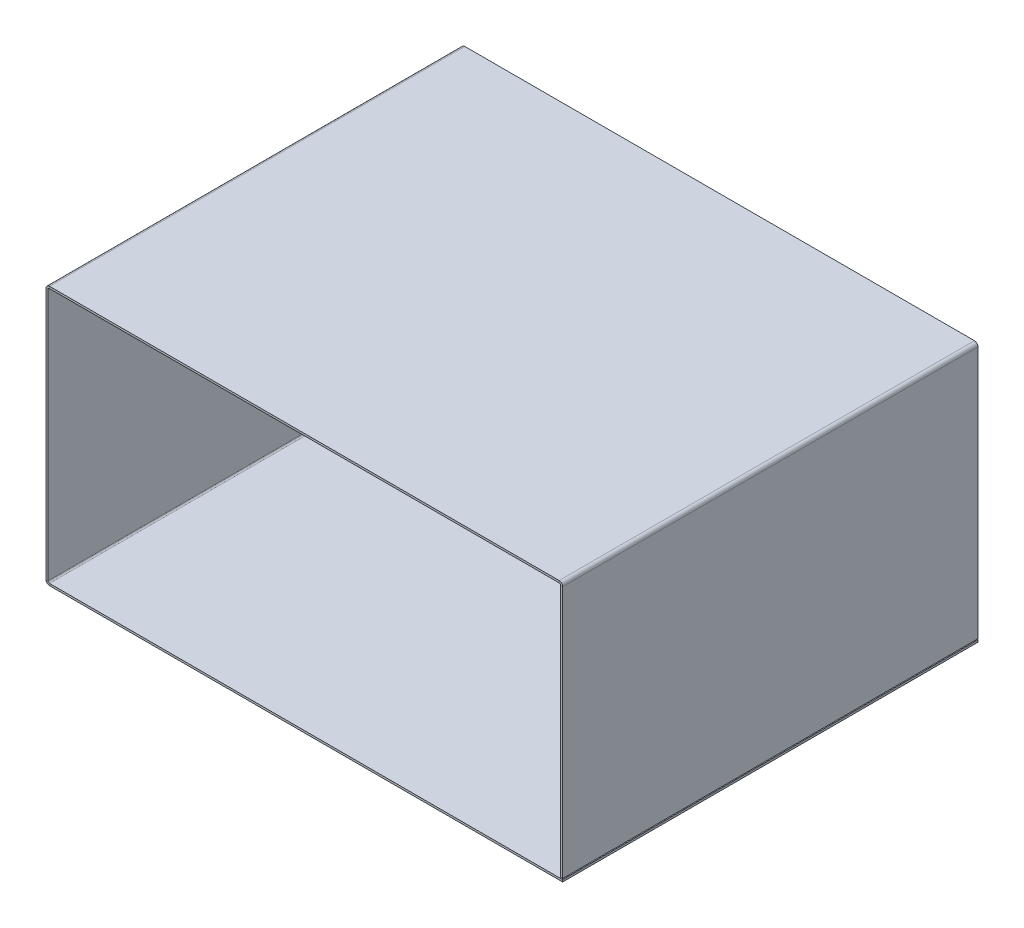
ISO-10303-21;
HEADER;
FILE_DESCRIPTION(('STEP AP214'),'2;1');
FILE_NAME('part.step','',(''),(''),'','','');
FILE_SCHEMA(('AUTOMOTIVE_DESIGN { 1 0 10303 214 1 1 1 1 }'));
ENDSEC;
DATA;
#1=APPLICATION_CONTEXT('core data for automotive mechanical design processes');
#2=APPLICATION_PROTOCOL_DEFINITION('international standard','automotive_design',2000,#1);
#3=PRODUCT_CONTEXT('',#1,'mechanical');
#4=PRODUCT('Part','Part','',(#3));
#5=PRODUCT_RELATED_PRODUCT_CATEGORY('part','',(#4));
#6=PRODUCT_DEFINITION_FORMATION('','',#4);
#7=PRODUCT_DEFINITION_CONTEXT('part definition',#1,'design');
#8=PRODUCT_DEFINITION('design','',#6,#7);
#9=PRODUCT_DEFINITION_SHAPE('','',#8);
#10=(LENGTH_UNIT() NAMED_UNIT(*) SI_UNIT(.MILLI.,.METRE.));
#11=(NAMED_UNIT(*) PLANE_ANGLE_UNIT() SI_UNIT($,.RADIAN.));
#12=(NAMED_UNIT(*) SI_UNIT($,.STERADIAN.) SOLID_ANGLE_UNIT());
#13=UNCERTAINTY_MEASURE_WITH_UNIT(LENGTH_MEASURE(1.E-05),#10,'distance_accuracy_value','');
#14=(GEOMETRIC_REPRESENTATION_CONTEXT(3) GLOBAL_UNCERTAINTY_ASSIGNED_CONTEXT((#13)) GLOBAL_UNIT_ASSIGNED_CONTEXT((#10,
#11,#12)) REPRESENTATION_CONTEXT('',''));
#15=CARTESIAN_POINT('',(0.,0.,0.));
#16=DIRECTION('',(0.,0.,1.));
#17=DIRECTION('',(1.,0.,0.));
#18=AXIS2_PLACEMENT_3D('',#15,#16,#17);
#19=CARTESIAN_POINT('',(127.5,127.000000000002,102.5));
#20=DIRECTION('',(0.,0.,-1.));
#21=DIRECTION('',(-1.,0.,0.));
#22=AXIS2_PLACEMENT_3D('',#19,#20,#21);
#23=PLANE('',#22);
#24=DIRECTION('',(0.,1.,0.));
#25=VECTOR('',#24,1.);
#26=CARTESIAN_POINT('',(125.7634,126.000000000002,102.5));
#27=LINE('',#26,#25);
#28=CARTESIAN_POINT('',(125.7634,126.000000000002,102.5));
#29=VERTEX_POINT('',#28);
#30=CARTESIAN_POINT('',(125.7634,127.000000000002,102.5));
#31=VERTEX_POINT('',#30);
#32=EDGE_CURVE('E269',#29,#31,#27,.T.);
#33=ORIENTED_EDGE('',*,*,#32,.T.);
#34=DIRECTION('',(1.,0.,0.));
#35=VECTOR('',#34,1.);
#36=CARTESIAN_POINT('',(-8.91669901038975E-13,127.000000000001,102.5));
#37=LINE('',#36,#35);
#38=CARTESIAN_POINT('',(-125.7634,127.,102.5));
#39=VERTEX_POINT('',#38);
#40=EDGE_CURVE('E284',#39,#31,#37,.T.);
#41=ORIENTED_EDGE('',*,*,#40,.F.);
#42=DIRECTION('',(0.,-1.,0.));
#43=VECTOR('',#42,1.);
#44=CARTESIAN_POINT('',(-125.7634,126.,102.5));
#45=LINE('',#44,#43);
#46=CARTESIAN_POINT('',(-125.7634,126.,102.5));
#47=VERTEX_POINT('',#46);
#48=EDGE_CURVE('E293',#47,#39,#45,.F.);
#49=ORIENTED_EDGE('',*,*,#48,.F.);
#50=DIRECTION('',(-1.,0.,0.));
#51=VECTOR('',#50,1.);
#52=CARTESIAN_POINT('',(127.5,126.000000000002,102.5));
#53=LINE('',#52,#51);
#54=EDGE_CURVE('E288',#47,#29,#53,.F.);
#55=ORIENTED_EDGE('',*,*,#54,.T.);
#56=EDGE_LOOP('',(#33,#41,#49,#55));
#57=FACE_BOUND('',#56,.T.);
#58=ADVANCED_FACE('F95',(#57),#23,.F.);
#59=CARTESIAN_POINT('',(-126.5,127.,-102.5));
#60=DIRECTION('',(0.,0.,1.));
#61=DIRECTION('',(1.,0.,0.));
#62=AXIS2_PLACEMENT_3D('',#59,#60,#61);
#63=PLANE('',#62);
#64=DIRECTION('',(0.,1.,0.));
#65=VECTOR('',#64,1.);
#66=CARTESIAN_POINT('',(125.7634,126.000000000002,-102.5));
#67=LINE('',#66,#65);
#68=CARTESIAN_POINT('',(125.7634,126.000000000002,-102.5));
#69=VERTEX_POINT('',#68);
#70=CARTESIAN_POINT('',(125.7634,127.000000000002,-102.5));
#71=VERTEX_POINT('',#70);
#72=EDGE_CURVE('E275',#69,#71,#67,.T.);
#73=ORIENTED_EDGE('',*,*,#72,.F.);
#74=DIRECTION('',(1.,0.,0.));
#75=VECTOR('',#74,1.);
#76=CARTESIAN_POINT('',(-126.5,126.,-102.5));
#77=LINE('',#76,#75);
#78=CARTESIAN_POINT('',(-125.7634,126.,-102.5));
#79=VERTEX_POINT('',#78);
#80=EDGE_CURVE('E286',#69,#79,#77,.F.);
#81=ORIENTED_EDGE('',*,*,#80,.T.);
#82=DIRECTION('',(0.,-1.,0.));
#83=VECTOR('',#82,1.);
#84=CARTESIAN_POINT('',(-125.7634,127.,-102.5));
#85=LINE('',#84,#83);
#86=CARTESIAN_POINT('',(-125.7634,127.,-102.5));
#87=VERTEX_POINT('',#86);
#88=EDGE_CURVE('E278',#79,#87,#85,.F.);
#89=ORIENTED_EDGE('',*,*,#88,.T.);
#90=DIRECTION('',(-1.,0.,0.));
#91=VECTOR('',#90,1.);
#92=CARTESIAN_POINT('',(-8.91669901038975E-13,127.000000000001,-102.5));
#93=LINE('',#92,#91);
#94=EDGE_CURVE('E281',#71,#87,#93,.T.);
#95=ORIENTED_EDGE('',*,*,#94,.F.);
#96=EDGE_LOOP('',(#73,#81,#89,#95));
#97=FACE_BOUND('',#96,.T.);
#98=ADVANCED_FACE('F415',(#97),#63,.F.);
#99=CARTESIAN_POINT('',(-8.91669901038975E-13,127.000000000001,0.));
#100=DIRECTION('',(0.,-1.,0.));
#101=DIRECTION('',(1.,0.,0.));
#102=AXIS2_PLACEMENT_3D('',#99,#100,#101);
#103=PLANE('',#102);
#104=DIRECTION('',(0.,0.,1.));
#105=VECTOR('',#104,1.);
#106=CARTESIAN_POINT('',(125.7634,127.000000000002,102.5));
#107=LINE('',#106,#105);
#108=EDGE_CURVE('E219',#31,#71,#107,.F.);
#109=ORIENTED_EDGE('',*,*,#108,.T.);
#110=ORIENTED_EDGE('',*,*,#94,.T.);
#111=DIRECTION('',(0.,0.,1.));
#112=VECTOR('',#111,1.);
#113=CARTESIAN_POINT('',(-125.7634,127.,-102.5));
#114=LINE('',#113,#112);
#115=EDGE_CURVE('E290',#39,#87,#114,.F.);
#116=ORIENTED_EDGE('',*,*,#115,.F.);
#117=ORIENTED_EDGE('',*,*,#40,.T.);
#118=EDGE_LOOP('',(#109,#110,#116,#117));
#119=FACE_BOUND('',#118,.T.);
#120=ADVANCED_FACE('F446',(#119),#103,.F.);
#121=CARTESIAN_POINT('',(-8.84681654268241E-13,126.000000000001,0.));
#122=DIRECTION('',(0.,-1.,0.));
#123=DIRECTION('',(1.,0.,0.));
#124=AXIS2_PLACEMENT_3D('',#121,#122,#123);
#125=PLANE('',#124);
#126=ORIENTED_EDGE('',*,*,#80,.F.);
#127=DIRECTION('',(0.,0.,1.));
#128=VECTOR('',#127,1.);
#129=CARTESIAN_POINT('',(125.7634,126.000000000002,102.5));
#130=LINE('',#129,#128);
#131=EDGE_CURVE('E110',#29,#69,#130,.F.);
#132=ORIENTED_EDGE('',*,*,#131,.F.);
#133=ORIENTED_EDGE('',*,*,#54,.F.);
#134=DIRECTION('',(0.,0.,1.));
#135=VECTOR('',#134,1.);
#136=CARTESIAN_POINT('',(-125.7634,126.,-102.5));
#137=LINE('',#136,#135);
#138=EDGE_CURVE('E296',#79,#47,#137,.T.);
#139=ORIENTED_EDGE('',*,*,#138,.F.);
#140=EDGE_LOOP('',(#126,#132,#133,#139));
#141=FACE_BOUND('',#140,.T.);
#142=ADVANCED_FACE('F416',(#141),#125,.T.);
#143=CARTESIAN_POINT('',(-127.5,127.,102.5));
#144=DIRECTION('',(0.,0.,-1.));
#145=DIRECTION('',(-1.,0.,0.));
#146=AXIS2_PLACEMENT_3D('',#143,#144,#145);
#147=PLANE('',#146);
#148=DIRECTION('',(-1.,0.,0.));
#149=VECTOR('',#148,1.);
#150=CARTESIAN_POINT('',(-126.5,125.2634,102.5));
#151=LINE('',#150,#149);
#152=CARTESIAN_POINT('',(-126.5,125.2634,102.5));
#153=VERTEX_POINT('',#152);
#154=CARTESIAN_POINT('',(-127.5,125.2634,102.5));
#155=VERTEX_POINT('',#154);
#156=EDGE_CURVE('E306',#153,#155,#151,.T.);
#157=ORIENTED_EDGE('',*,*,#156,.T.);
#158=DIRECTION('',(0.,1.,0.));
#159=VECTOR('',#158,1.);
#160=CARTESIAN_POINT('',(-127.5,-4.49329073904851E-13,102.5));
#161=LINE('',#160,#159);
#162=CARTESIAN_POINT('',(-127.5,0.7366,102.5));
#163=VERTEX_POINT('',#162);
#164=EDGE_CURVE('E324',#163,#155,#161,.T.);
#165=ORIENTED_EDGE('',*,*,#164,.F.);
#166=DIRECTION('',(1.,0.,0.));
#167=VECTOR('',#166,1.);
#168=CARTESIAN_POINT('',(-126.5,0.736600000000004,102.5));
#169=LINE('',#168,#167);
#170=CARTESIAN_POINT('',(-126.5,0.736600000000004,102.5));
#171=VERTEX_POINT('',#170);
#172=EDGE_CURVE('E333',#171,#163,#169,.F.);
#173=ORIENTED_EDGE('',*,*,#172,.F.);
#174=DIRECTION('',(0.,-1.,0.));
#175=VECTOR('',#174,1.);
#176=CARTESIAN_POINT('',(-126.5,127.,102.5));
#177=LINE('',#176,#175);
#178=EDGE_CURVE('E328',#171,#153,#177,.F.);
#179=ORIENTED_EDGE('',*,*,#178,.T.);
#180=EDGE_LOOP('',(#157,#165,#173,#179));
#181=FACE_BOUND('',#180,.T.);
#182=ADVANCED_FACE('F470',(#181),#147,.F.);
#183=CARTESIAN_POINT('',(-127.5,0.,-102.5));
#184=DIRECTION('',(0.,0.,1.));
#185=DIRECTION('',(1.,0.,0.));
#186=AXIS2_PLACEMENT_3D('',#183,#184,#185);
#187=PLANE('',#186);
#188=DIRECTION('',(-1.,0.,0.));
#189=VECTOR('',#188,1.);
#190=CARTESIAN_POINT('',(-126.5,125.2634,-102.5));
#191=LINE('',#190,#189);
#192=CARTESIAN_POINT('',(-126.5,125.2634,-102.5));
#193=VERTEX_POINT('',#192);
#194=CARTESIAN_POINT('',(-127.5,125.2634,-102.5));
#195=VERTEX_POINT('',#194);
#196=EDGE_CURVE('E315',#193,#195,#191,.T.);
#197=ORIENTED_EDGE('',*,*,#196,.F.);
#198=DIRECTION('',(0.,1.,0.));
#199=VECTOR('',#198,1.);
#200=CARTESIAN_POINT('',(-126.5,0.,-102.5));
#201=LINE('',#200,#199);
#202=CARTESIAN_POINT('',(-126.5,0.736600000000004,-102.5));
#203=VERTEX_POINT('',#202);
#204=EDGE_CURVE('E326',#193,#203,#201,.F.);
#205=ORIENTED_EDGE('',*,*,#204,.T.);
#206=DIRECTION('',(1.,0.,0.));
#207=VECTOR('',#206,1.);
#208=CARTESIAN_POINT('',(-127.5,0.7366,-102.5));
#209=LINE('',#208,#207);
#210=CARTESIAN_POINT('',(-127.5,0.7366,-102.5));
#211=VERTEX_POINT('',#210);
#212=EDGE_CURVE('E318',#203,#211,#209,.F.);
#213=ORIENTED_EDGE('',*,*,#212,.T.);
#214=DIRECTION('',(0.,-1.,0.));
#215=VECTOR('',#214,1.);
#216=CARTESIAN_POINT('',(-127.5,-4.49329073904851E-13,-102.5));
#217=LINE('',#216,#215);
#218=EDGE_CURVE('E321',#195,#211,#217,.T.);
#219=ORIENTED_EDGE('',*,*,#218,.F.);
#220=EDGE_LOOP('',(#197,#205,#213,#219));
#221=FACE_BOUND('',#220,.T.);
#222=ADVANCED_FACE('F402',(#221),#187,.F.);
#223=CARTESIAN_POINT('',(-127.5,-4.49329073904851E-13,0.));
#224=DIRECTION('',(1.,0.,0.));
#225=DIRECTION('',(0.,1.,0.));
#226=AXIS2_PLACEMENT_3D('',#223,#224,#225);
#227=PLANE('',#226);
#228=DIRECTION('',(0.,0.,1.));
#229=VECTOR('',#228,1.);
#230=CARTESIAN_POINT('',(-127.5,125.2634,102.5));
#231=LINE('',#230,#229);
#232=EDGE_CURVE('E300',#155,#195,#231,.F.);
#233=ORIENTED_EDGE('',*,*,#232,.T.);
#234=ORIENTED_EDGE('',*,*,#218,.T.);
#235=DIRECTION('',(0.,0.,1.));
#236=VECTOR('',#235,1.);
#237=CARTESIAN_POINT('',(-127.5,0.7366,-102.5));
#238=LINE('',#237,#236);
#239=EDGE_CURVE('E330',#163,#211,#238,.F.);
#240=ORIENTED_EDGE('',*,*,#239,.F.);
#241=ORIENTED_EDGE('',*,*,#164,.T.);
#242=EDGE_LOOP('',(#233,#234,#240,#241));
#243=FACE_BOUND('',#242,.T.);
#244=ADVANCED_FACE('F462',(#243),#227,.F.);
#245=CARTESIAN_POINT('',(-126.5,-4.45837592566008E-13,0.));
#246=DIRECTION('',(1.,0.,0.));
#247=DIRECTION('',(0.,1.,0.));
#248=AXIS2_PLACEMENT_3D('',#245,#246,#247);
#249=PLANE('',#248);
#250=ORIENTED_EDGE('',*,*,#204,.F.);
#251=DIRECTION('',(0.,0.,1.));
#252=VECTOR('',#251,1.);
#253=CARTESIAN_POINT('',(-126.5,125.2634,102.5));
#254=LINE('',#253,#252);
#255=EDGE_CURVE('E118',#153,#193,#254,.F.);
#256=ORIENTED_EDGE('',*,*,#255,.F.);
#257=ORIENTED_EDGE('',*,*,#178,.F.);
#258=DIRECTION('',(0.,0.,1.));
#259=VECTOR('',#258,1.);
#260=CARTESIAN_POINT('',(-126.5,0.736600000000004,-102.5));
#261=LINE('',#260,#259);
#262=EDGE_CURVE('E336',#203,#171,#261,.T.);
#263=ORIENTED_EDGE('',*,*,#262,.F.);
#264=EDGE_LOOP('',(#250,#256,#257,#263));
#265=FACE_BOUND('',#264,.T.);
#266=ADVANCED_FACE('F403',(#265),#249,.T.);
#267=CARTESIAN_POINT('',(-127.5,-1.,102.5));
#268=DIRECTION('',(0.,0.,1.));
#269=DIRECTION('',(1.,0.,0.));
#270=AXIS2_PLACEMENT_3D('',#267,#268,#269);
#271=PLANE('',#270);
#272=DIRECTION('',(1.,0.,0.));
#273=VECTOR('',#272,1.);
#274=CARTESIAN_POINT('',(-127.5,0.,102.5));
#275=LINE('',#274,#273);
#276=CARTESIAN_POINT('',(-125.7634,0.,102.5));
#277=VERTEX_POINT('',#276);
#278=CARTESIAN_POINT('',(127.5,0.,102.5));
#279=VERTEX_POINT('',#278);
#280=EDGE_CURVE('E367',#277,#279,#275,.T.);
#281=ORIENTED_EDGE('',*,*,#280,.F.);
#282=DIRECTION('',(0.,-1.,0.));
#283=VECTOR('',#282,1.);
#284=CARTESIAN_POINT('',(-125.7634,0.,102.5));
#285=LINE('',#284,#283);
#286=CARTESIAN_POINT('',(-125.7634,-0.999999999999997,102.5));
#287=VERTEX_POINT('',#286);
#288=EDGE_CURVE('E346',#277,#287,#285,.T.);
#289=ORIENTED_EDGE('',*,*,#288,.T.);
#290=DIRECTION('',(1.,0.,0.));
#291=VECTOR('',#290,1.);
#292=CARTESIAN_POINT('',(-127.5,-1.,102.5));
#293=LINE('',#292,#291);
#294=CARTESIAN_POINT('',(127.5,-1.,102.5));
#295=VERTEX_POINT('',#294);
#296=EDGE_CURVE('E370',#287,#295,#293,.T.);
#297=ORIENTED_EDGE('',*,*,#296,.T.);
#298=DIRECTION('',(0.,1.,0.));
#299=VECTOR('',#298,1.);
#300=CARTESIAN_POINT('',(127.5,-1.,102.5));
#301=LINE('',#300,#299);
#302=EDGE_CURVE('E13',#295,#279,#301,.T.);
#303=ORIENTED_EDGE('',*,*,#302,.T.);
#304=EDGE_LOOP('',(#281,#289,#297,#303));
#305=FACE_BOUND('',#304,.T.);
#306=ADVANCED_FACE('F384',(#305),#271,.T.);
#307=CARTESIAN_POINT('',(0.,-1.,0.));
#308=DIRECTION('',(0.,1.,0.));
#309=DIRECTION('',(0.,0.,1.));
#310=AXIS2_PLACEMENT_3D('',#307,#308,#309);
#311=PLANE('',#310);
#312=DIRECTION('',(0.,0.,1.));
#313=VECTOR('',#312,1.);
#314=CARTESIAN_POINT('',(-125.7634,-0.999999999999997,102.5));
#315=LINE('',#314,#313);
#316=CARTESIAN_POINT('',(-125.7634,-1.,-102.5));
#317=VERTEX_POINT('',#316);
#318=EDGE_CURVE('E340',#287,#317,#315,.F.);
#319=ORIENTED_EDGE('',*,*,#318,.T.);
#320=DIRECTION('',(-1.,0.,0.));
#321=VECTOR('',#320,1.);
#322=CARTESIAN_POINT('',(-127.5,-1.,-102.5));
#323=LINE('',#322,#321);
#324=CARTESIAN_POINT('',(127.5,-1.,-102.5));
#325=VERTEX_POINT('',#324);
#326=EDGE_CURVE('E366',#325,#317,#323,.T.);
#327=ORIENTED_EDGE('',*,*,#326,.F.);
#328=DIRECTION('',(0.,0.,-1.));
#329=VECTOR('',#328,1.);
#330=CARTESIAN_POINT('',(127.5,-1.,-102.5));
#331=LINE('',#330,#329);
#332=EDGE_CURVE('E363',#295,#325,#331,.T.);
#333=ORIENTED_EDGE('',*,*,#332,.F.);
#334=ORIENTED_EDGE('',*,*,#296,.F.);
#335=EDGE_LOOP('',(#319,#327,#333,#334));
#336=FACE_BOUND('',#335,.T.);
#337=ADVANCED_FACE('F486',(#336),#311,.F.);
#338=CARTESIAN_POINT('',(0.,0.,0.));
#339=DIRECTION('',(0.,1.,0.));
#340=DIRECTION('',(0.,0.,1.));
#341=AXIS2_PLACEMENT_3D('',#338,#339,#340);
#342=PLANE('',#341);
#343=DIRECTION('',(-1.,0.,0.));
#344=VECTOR('',#343,1.);
#345=CARTESIAN_POINT('',(-127.5,0.,-102.5));
#346=LINE('',#345,#344);
#347=CARTESIAN_POINT('',(127.5,0.,-102.5));
#348=VERTEX_POINT('',#347);
#349=CARTESIAN_POINT('',(-125.7634,0.,-102.5));
#350=VERTEX_POINT('',#349);
#351=EDGE_CURVE('E374',#348,#350,#346,.T.);
#352=ORIENTED_EDGE('',*,*,#351,.T.);
#353=DIRECTION('',(0.,0.,1.));
#354=VECTOR('',#353,1.);
#355=CARTESIAN_POINT('',(-125.7634,0.,102.5));
#356=LINE('',#355,#354);
#357=EDGE_CURVE('E352',#277,#350,#356,.F.);
#358=ORIENTED_EDGE('',*,*,#357,.F.);
#359=ORIENTED_EDGE('',*,*,#280,.T.);
#360=DIRECTION('',(0.,0.,-1.));
#361=VECTOR('',#360,1.);
#362=CARTESIAN_POINT('',(127.5,0.,-102.5));
#363=LINE('',#362,#361);
#364=EDGE_CURVE('E360',#279,#348,#363,.T.);
#365=ORIENTED_EDGE('',*,*,#364,.T.);
#366=EDGE_LOOP('',(#352,#358,#359,#365));
#367=FACE_BOUND('',#366,.T.);
#368=ADVANCED_FACE('F379',(#367),#342,.T.);
#369=CARTESIAN_POINT('',(127.5,-1.,-102.5));
#370=DIRECTION('',(1.,0.,0.));
#371=DIRECTION('',(0.,0.,-1.));
#372=AXIS2_PLACEMENT_3D('',#369,#370,#371);
#373=PLANE('',#372);
#374=ORIENTED_EDGE('',*,*,#364,.F.);
#375=ORIENTED_EDGE('',*,*,#302,.F.);
#376=ORIENTED_EDGE('',*,*,#332,.T.);
#377=DIRECTION('',(0.,1.,0.));
#378=VECTOR('',#377,1.);
#379=CARTESIAN_POINT('',(127.5,-1.,-102.5));
#380=LINE('',#379,#378);
#381=EDGE_CURVE('E99',#325,#348,#380,.T.);
#382=ORIENTED_EDGE('',*,*,#381,.T.);
#383=EDGE_LOOP('',(#374,#375,#376,#382));
#384=FACE_BOUND('',#383,.T.);
#385=ADVANCED_FACE('F97',(#384),#373,.T.);
#386=CARTESIAN_POINT('',(-127.5,-1.,-102.5));
#387=DIRECTION('',(0.,0.,-1.));
#388=DIRECTION('',(-1.,0.,0.));
#389=AXIS2_PLACEMENT_3D('',#386,#387,#388);
#390=PLANE('',#389);
#391=DIRECTION('',(0.,-1.,0.));
#392=VECTOR('',#391,1.);
#393=CARTESIAN_POINT('',(-125.7634,0.,-102.5));
#394=LINE('',#393,#392);
#395=EDGE_CURVE('E357',#350,#317,#394,.T.);
#396=ORIENTED_EDGE('',*,*,#395,.F.);
#397=ORIENTED_EDGE('',*,*,#351,.F.);
#398=ORIENTED_EDGE('',*,*,#381,.F.);
#399=ORIENTED_EDGE('',*,*,#326,.T.);
#400=EDGE_LOOP('',(#396,#397,#398,#399));
#401=FACE_BOUND('',#400,.T.);
#402=ADVANCED_FACE('F390',(#401),#390,.T.);
#403=CARTESIAN_POINT('',(-125.7634,0.736600000000006,-102.5));
#404=DIRECTION('',(0.,0.,-1.));
#405=DIRECTION('',(-1.,0.,0.));
#406=AXIS2_PLACEMENT_3D('',#403,#404,#405);
#407=PLANE('',#406);
#408=ORIENTED_EDGE('',*,*,#212,.F.);
#409=CARTESIAN_POINT('',(-125.7634,0.736600000000006,-102.5));
#410=DIRECTION('',(0.,0.,1.));
#411=DIRECTION('',(1.,0.,0.));
#412=AXIS2_PLACEMENT_3D('',#409,#410,#411);
#413=CIRCLE('',#412,0.736600000000004);
#414=EDGE_CURVE('E349',#350,#203,#413,.F.);
#415=ORIENTED_EDGE('',*,*,#414,.F.);
#416=ORIENTED_EDGE('',*,*,#395,.T.);
#417=CARTESIAN_POINT('',(-125.7634,0.736600000000006,-102.5));
#418=DIRECTION('',(0.,0.,1.));
#419=DIRECTION('',(1.,0.,0.));
#420=AXIS2_PLACEMENT_3D('',#417,#418,#419);
#421=CIRCLE('',#420,1.7366);
#422=EDGE_CURVE('E342',#317,#211,#421,.F.);
#423=ORIENTED_EDGE('',*,*,#422,.T.);
#424=EDGE_LOOP('',(#408,#415,#416,#423));
#425=FACE_BOUND('',#424,.T.);
#426=ADVANCED_FACE('F398',(#425),#407,.T.);
#427=CARTESIAN_POINT('',(-125.7634,0.736600000000006,102.5));
#428=DIRECTION('',(0.,0.,-1.));
#429=DIRECTION('',(-1.,0.,0.));
#430=AXIS2_PLACEMENT_3D('',#427,#428,#429);
#431=PLANE('',#430);
#432=CARTESIAN_POINT('',(-125.7634,0.736600000000006,102.5));
#433=DIRECTION('',(0.,0.,1.));
#434=DIRECTION('',(1.,0.,0.));
#435=AXIS2_PLACEMENT_3D('',#432,#433,#434);
#436=CIRCLE('',#435,0.736600000000004);
#437=EDGE_CURVE('E323',#171,#277,#436,.T.);
#438=ORIENTED_EDGE('',*,*,#437,.F.);
#439=ORIENTED_EDGE('',*,*,#172,.T.);
#440=CARTESIAN_POINT('',(-125.7634,0.736600000000006,102.5));
#441=DIRECTION('',(0.,0.,1.));
#442=DIRECTION('',(1.,0.,0.));
#443=AXIS2_PLACEMENT_3D('',#440,#441,#442);
#444=CIRCLE('',#443,1.7366);
#445=EDGE_CURVE('E343',#163,#287,#444,.T.);
#446=ORIENTED_EDGE('',*,*,#445,.T.);
#447=ORIENTED_EDGE('',*,*,#288,.F.);
#448=EDGE_LOOP('',(#438,#439,#446,#447));
#449=FACE_BOUND('',#448,.T.);
#450=ADVANCED_FACE('F477',(#449),#431,.F.);
#451=CARTESIAN_POINT('',(-125.7634,0.736600000000006,102.5));
#452=DIRECTION('',(0.,0.,1.));
#453=DIRECTION('',(-1.,0.,0.));
#454=AXIS2_PLACEMENT_3D('',#451,#452,#453);
#455=CYLINDRICAL_SURFACE('',#454,1.7366);
#456=ORIENTED_EDGE('',*,*,#318,.F.);
#457=ORIENTED_EDGE('',*,*,#445,.F.);
#458=ORIENTED_EDGE('',*,*,#239,.T.);
#459=ORIENTED_EDGE('',*,*,#422,.F.);
#460=EDGE_LOOP('',(#456,#457,#458,#459));
#461=FACE_BOUND('',#460,.T.);
#462=ADVANCED_FACE('F474',(#461),#455,.T.);
#463=CARTESIAN_POINT('',(-125.7634,0.736600000000006,102.5));
#464=DIRECTION('',(0.,0.,1.));
#465=DIRECTION('',(-1.,0.,0.));
#466=AXIS2_PLACEMENT_3D('',#463,#464,#465);
#467=CYLINDRICAL_SURFACE('',#466,0.736600000000004);
#468=ORIENTED_EDGE('',*,*,#357,.T.);
#469=ORIENTED_EDGE('',*,*,#414,.T.);
#470=ORIENTED_EDGE('',*,*,#262,.T.);
#471=ORIENTED_EDGE('',*,*,#437,.T.);
#472=EDGE_LOOP('',(#468,#469,#470,#471));
#473=FACE_BOUND('',#472,.T.);
#474=ADVANCED_FACE('F393',(#473),#467,.F.);
#475=CARTESIAN_POINT('',(-125.7634,125.2634,-102.5));
#476=DIRECTION('',(0.,0.,-1.));
#477=DIRECTION('',(-1.,0.,0.));
#478=AXIS2_PLACEMENT_3D('',#475,#476,#477);
#479=PLANE('',#478);
#480=ORIENTED_EDGE('',*,*,#88,.F.);
#481=CARTESIAN_POINT('',(-125.7634,125.2634,-102.5));
#482=DIRECTION('',(0.,0.,1.));
#483=DIRECTION('',(1.,0.,0.));
#484=AXIS2_PLACEMENT_3D('',#481,#482,#483);
#485=CIRCLE('',#484,0.736600000000004);
#486=EDGE_CURVE('E309',#193,#79,#485,.F.);
#487=ORIENTED_EDGE('',*,*,#486,.F.);
#488=ORIENTED_EDGE('',*,*,#196,.T.);
#489=CARTESIAN_POINT('',(-125.7634,125.2634,-102.5));
#490=DIRECTION('',(0.,0.,1.));
#491=DIRECTION('',(1.,0.,0.));
#492=AXIS2_PLACEMENT_3D('',#489,#490,#491);
#493=CIRCLE('',#492,1.7366);
#494=EDGE_CURVE('E302',#195,#87,#493,.F.);
#495=ORIENTED_EDGE('',*,*,#494,.T.);
#496=EDGE_LOOP('',(#480,#487,#488,#495));
#497=FACE_BOUND('',#496,.T.);
#498=ADVANCED_FACE('F411',(#497),#479,.T.);
#499=CARTESIAN_POINT('',(-125.7634,125.2634,102.5));
#500=DIRECTION('',(0.,0.,-1.));
#501=DIRECTION('',(-1.,0.,0.));
#502=AXIS2_PLACEMENT_3D('',#499,#500,#501);
#503=PLANE('',#502);
#504=CARTESIAN_POINT('',(-125.7634,125.2634,102.5));
#505=DIRECTION('',(0.,0.,1.));
#506=DIRECTION('',(1.,0.,0.));
#507=AXIS2_PLACEMENT_3D('',#504,#505,#506);
#508=CIRCLE('',#507,0.736600000000004);
#509=EDGE_CURVE('E283',#47,#153,#508,.T.);
#510=ORIENTED_EDGE('',*,*,#509,.F.);
#511=ORIENTED_EDGE('',*,*,#48,.T.);
#512=CARTESIAN_POINT('',(-125.7634,125.2634,102.5));
#513=DIRECTION('',(0.,0.,1.));
#514=DIRECTION('',(1.,0.,0.));
#515=AXIS2_PLACEMENT_3D('',#512,#513,#514);
#516=CIRCLE('',#515,1.7366);
#517=EDGE_CURVE('E303',#39,#155,#516,.T.);
#518=ORIENTED_EDGE('',*,*,#517,.T.);
#519=ORIENTED_EDGE('',*,*,#156,.F.);
#520=EDGE_LOOP('',(#510,#511,#518,#519));
#521=FACE_BOUND('',#520,.T.);
#522=ADVANCED_FACE('F453',(#521),#503,.F.);
#523=CARTESIAN_POINT('',(-125.7634,125.2634,102.5));
#524=DIRECTION('',(0.,0.,1.));
#525=DIRECTION('',(0.,1.,0.));
#526=AXIS2_PLACEMENT_3D('',#523,#524,#525);
#527=CYLINDRICAL_SURFACE('',#526,1.7366);
#528=ORIENTED_EDGE('',*,*,#232,.F.);
#529=ORIENTED_EDGE('',*,*,#517,.F.);
#530=ORIENTED_EDGE('',*,*,#115,.T.);
#531=ORIENTED_EDGE('',*,*,#494,.F.);
#532=EDGE_LOOP('',(#528,#529,#530,#531));
#533=FACE_BOUND('',#532,.T.);
#534=ADVANCED_FACE('F450',(#533),#527,.T.);
#535=CARTESIAN_POINT('',(-125.7634,125.2634,102.5));
#536=DIRECTION('',(0.,0.,1.));
#537=DIRECTION('',(0.,1.,0.));
#538=AXIS2_PLACEMENT_3D('',#535,#536,#537);
#539=CYLINDRICAL_SURFACE('',#538,0.736600000000004);
#540=ORIENTED_EDGE('',*,*,#255,.T.);
#541=ORIENTED_EDGE('',*,*,#486,.T.);
#542=ORIENTED_EDGE('',*,*,#138,.T.);
#543=ORIENTED_EDGE('',*,*,#509,.T.);
#544=EDGE_LOOP('',(#540,#541,#542,#543));
#545=FACE_BOUND('',#544,.T.);
#546=ADVANCED_FACE('F406',(#545),#539,.F.);
#547=CARTESIAN_POINT('',(125.7634,125.263400000002,-102.5));
#548=DIRECTION('',(0.,0.,-1.));
#549=DIRECTION('',(-1.,0.,0.));
#550=AXIS2_PLACEMENT_3D('',#547,#548,#549);
#551=PLANE('',#550);
#552=DIRECTION('',(1.,0.,0.));
#553=VECTOR('',#552,1.);
#554=CARTESIAN_POINT('',(127.5,125.263400000002,-102.5));
#555=LINE('',#554,#553);
#556=CARTESIAN_POINT('',(126.5,125.263400000002,-102.5));
#557=VERTEX_POINT('',#556);
#558=CARTESIAN_POINT('',(127.5,125.263400000002,-102.5));
#559=VERTEX_POINT('',#558);
#560=EDGE_CURVE('E264',#557,#559,#555,.T.);
#561=ORIENTED_EDGE('',*,*,#560,.F.);
#562=CARTESIAN_POINT('',(125.7634,125.263400000002,-102.5));
#563=DIRECTION('',(0.,0.,1.));
#564=DIRECTION('',(1.,0.,0.));
#565=AXIS2_PLACEMENT_3D('',#562,#563,#564);
#566=CIRCLE('',#565,0.736600000000004);
#567=EDGE_CURVE('E222',#69,#557,#566,.F.);
#568=ORIENTED_EDGE('',*,*,#567,.F.);
#569=ORIENTED_EDGE('',*,*,#72,.T.);
#570=CARTESIAN_POINT('',(125.7634,125.263400000002,-102.5));
#571=DIRECTION('',(0.,0.,1.));
#572=DIRECTION('',(1.,0.,0.));
#573=AXIS2_PLACEMENT_3D('',#570,#571,#572);
#574=CIRCLE('',#573,1.7366);
#575=EDGE_CURVE('E268',#71,#559,#574,.F.);
#576=ORIENTED_EDGE('',*,*,#575,.T.);
#577=EDGE_LOOP('',(#561,#568,#569,#576));
#578=FACE_BOUND('',#577,.T.);
#579=ADVANCED_FACE('F422',(#578),#551,.T.);
#580=CARTESIAN_POINT('',(125.7634,125.263400000002,102.5));
#581=DIRECTION('',(0.,0.,-1.));
#582=DIRECTION('',(-1.,0.,0.));
#583=AXIS2_PLACEMENT_3D('',#580,#581,#582);
#584=PLANE('',#583);
#585=CARTESIAN_POINT('',(125.7634,125.263400000002,102.5));
#586=DIRECTION('',(0.,0.,1.));
#587=DIRECTION('',(1.,0.,0.));
#588=AXIS2_PLACEMENT_3D('',#585,#586,#587);
#589=CIRCLE('',#588,0.736600000000004);
#590=CARTESIAN_POINT('',(126.5,125.263400000002,102.5));
#591=VERTEX_POINT('',#590);
#592=EDGE_CURVE('E229',#591,#29,#589,.T.);
#593=ORIENTED_EDGE('',*,*,#592,.F.);
#594=DIRECTION('',(1.,0.,0.));
#595=VECTOR('',#594,1.);
#596=CARTESIAN_POINT('',(126.5,125.263400000002,102.5));
#597=LINE('',#596,#595);
#598=CARTESIAN_POINT('',(127.5,125.263400000002,102.5));
#599=VERTEX_POINT('',#598);
#600=EDGE_CURVE('E226',#591,#599,#597,.T.);
#601=ORIENTED_EDGE('',*,*,#600,.T.);
#602=CARTESIAN_POINT('',(125.7634,125.263400000002,102.5));
#603=DIRECTION('',(0.,0.,1.));
#604=DIRECTION('',(1.,0.,0.));
#605=AXIS2_PLACEMENT_3D('',#602,#603,#604);
#606=CIRCLE('',#605,1.7366);
#607=EDGE_CURVE('E212',#599,#31,#606,.T.);
#608=ORIENTED_EDGE('',*,*,#607,.T.);
#609=ORIENTED_EDGE('',*,*,#32,.F.);
#610=EDGE_LOOP('',(#593,#601,#608,#609));
#611=FACE_BOUND('',#610,.T.);
#612=ADVANCED_FACE('F227',(#611),#584,.F.);
#613=CARTESIAN_POINT('',(125.7634,125.263400000002,102.5));
#614=DIRECTION('',(0.,0.,1.));
#615=DIRECTION('',(1.,0.,0.));
#616=AXIS2_PLACEMENT_3D('',#613,#614,#615);
#617=CYLINDRICAL_SURFACE('',#616,1.7366);
#618=ORIENTED_EDGE('',*,*,#108,.F.);
#619=ORIENTED_EDGE('',*,*,#607,.F.);
#620=DIRECTION('',(0.,0.,1.));
#621=VECTOR('',#620,1.);
#622=CARTESIAN_POINT('',(127.5,125.263400000002,0.));
#623=LINE('',#622,#621);
#624=EDGE_CURVE('E217',#559,#599,#623,.T.);
#625=ORIENTED_EDGE('',*,*,#624,.F.);
#626=ORIENTED_EDGE('',*,*,#575,.F.);
#627=EDGE_LOOP('',(#618,#619,#625,#626));
#628=FACE_BOUND('',#627,.T.);
#629=ADVANCED_FACE('F214',(#628),#617,.T.);
#630=CARTESIAN_POINT('',(125.7634,125.263400000002,102.5));
#631=DIRECTION('',(0.,0.,1.));
#632=DIRECTION('',(1.,0.,0.));
#633=AXIS2_PLACEMENT_3D('',#630,#631,#632);
#634=CYLINDRICAL_SURFACE('',#633,0.736600000000004);
#635=ORIENTED_EDGE('',*,*,#131,.T.);
#636=ORIENTED_EDGE('',*,*,#567,.T.);
#637=DIRECTION('',(0.,0.,-1.));
#638=VECTOR('',#637,1.);
#639=CARTESIAN_POINT('',(126.5,125.263400000002,-102.5));
#640=LINE('',#639,#638);
#641=EDGE_CURVE('E234',#557,#591,#640,.F.);
#642=ORIENTED_EDGE('',*,*,#641,.T.);
#643=ORIENTED_EDGE('',*,*,#592,.T.);
#644=EDGE_LOOP('',(#635,#636,#642,#643));
#645=FACE_BOUND('',#644,.T.);
#646=ADVANCED_FACE('F419',(#645),#634,.F.);
#647=CARTESIAN_POINT('',(127.5,126.000000000002,102.5));
#648=DIRECTION('',(0.,0.,1.));
#649=DIRECTION('',(1.,0.,0.));
#650=AXIS2_PLACEMENT_3D('',#647,#648,#649);
#651=PLANE('',#650);
#652=DIRECTION('',(0.,1.,0.));
#653=VECTOR('',#652,1.);
#654=CARTESIAN_POINT('',(127.5,126.000000000002,102.5));
#655=LINE('',#654,#653);
#656=CARTESIAN_POINT('',(127.500000000001,0.500000000001779,102.5));
#657=VERTEX_POINT('',#656);
#658=EDGE_CURVE('E241',#657,#599,#655,.T.);
#659=ORIENTED_EDGE('',*,*,#658,.T.);
#660=ORIENTED_EDGE('',*,*,#600,.F.);
#661=DIRECTION('',(0.,-1.,0.));
#662=VECTOR('',#661,1.);
#663=CARTESIAN_POINT('',(126.500000000001,1.31830755978688E-12,102.5));
#664=LINE('',#663,#662);
#665=CARTESIAN_POINT('',(126.500000000001,0.50000000000177,102.5));
#666=VERTEX_POINT('',#665);
#667=EDGE_CURVE('E257',#666,#591,#664,.F.);
#668=ORIENTED_EDGE('',*,*,#667,.F.);
#669=DIRECTION('',(-1.,0.,0.));
#670=VECTOR('',#669,1.);
#671=CARTESIAN_POINT('',(127.500000000001,0.50000000000178,102.5));
#672=LINE('',#671,#670);
#673=EDGE_CURVE('E246',#657,#666,#672,.T.);
#674=ORIENTED_EDGE('',*,*,#673,.F.);
#675=EDGE_LOOP('',(#659,#660,#668,#674));
#676=FACE_BOUND('',#675,.T.);
#677=ADVANCED_FACE('F245',(#676),#651,.T.);
#678=CARTESIAN_POINT('',(127.500000000001,0.50000000000178,-102.5));
#679=DIRECTION('',(0.,0.,-1.));
#680=DIRECTION('',(-1.,0.,0.));
#681=AXIS2_PLACEMENT_3D('',#678,#679,#680);
#682=PLANE('',#681);
#683=DIRECTION('',(0.,1.,0.));
#684=VECTOR('',#683,1.);
#685=CARTESIAN_POINT('',(126.500000000001,1.31830755978688E-12,-102.5));
#686=LINE('',#685,#684);
#687=CARTESIAN_POINT('',(126.500000000001,0.50000000000177,-102.5));
#688=VERTEX_POINT('',#687);
#689=EDGE_CURVE('E243',#557,#688,#686,.F.);
#690=ORIENTED_EDGE('',*,*,#689,.F.);
#691=ORIENTED_EDGE('',*,*,#560,.T.);
#692=DIRECTION('',(0.,-1.,0.));
#693=VECTOR('',#692,1.);
#694=CARTESIAN_POINT('',(127.500000000001,0.50000000000178,-102.5));
#695=LINE('',#694,#693);
#696=CARTESIAN_POINT('',(127.500000000001,0.50000000000178,-102.5));
#697=VERTEX_POINT('',#696);
#698=EDGE_CURVE('E242',#559,#697,#695,.T.);
#699=ORIENTED_EDGE('',*,*,#698,.T.);
#700=DIRECTION('',(-1.,0.,0.));
#701=VECTOR('',#700,1.);
#702=CARTESIAN_POINT('',(127.500000000001,0.50000000000178,-102.5));
#703=LINE('',#702,#701);
#704=EDGE_CURVE('E248',#697,#688,#703,.T.);
#705=ORIENTED_EDGE('',*,*,#704,.T.);
#706=EDGE_LOOP('',(#690,#691,#699,#705));
#707=FACE_BOUND('',#706,.T.);
#708=ADVANCED_FACE('F425',(#707),#682,.T.);
#709=CARTESIAN_POINT('',(127.500000000001,1.3287925719895E-12,0.));
#710=DIRECTION('',(1.,0.,0.));
#711=DIRECTION('',(0.,1.,0.));
#712=AXIS2_PLACEMENT_3D('',#709,#710,#711);
#713=PLANE('',#712);
#714=ORIENTED_EDGE('',*,*,#698,.F.);
#715=ORIENTED_EDGE('',*,*,#624,.T.);
#716=ORIENTED_EDGE('',*,*,#658,.F.);
#717=DIRECTION('',(0.,0.,1.));
#718=VECTOR('',#717,1.);
#719=CARTESIAN_POINT('',(127.500000000001,0.50000000000178,102.5));
#720=LINE('',#719,#718);
#721=EDGE_CURVE('E249',#697,#657,#720,.T.);
#722=ORIENTED_EDGE('',*,*,#721,.F.);
#723=EDGE_LOOP('',(#714,#715,#716,#722));
#724=FACE_BOUND('',#723,.T.);
#725=ADVANCED_FACE('F239',(#724),#713,.T.);
#726=CARTESIAN_POINT('',(126.500000000001,1.31830755978688E-12,0.));
#727=DIRECTION('',(1.,0.,0.));
#728=DIRECTION('',(0.,1.,0.));
#729=AXIS2_PLACEMENT_3D('',#726,#727,#728);
#730=PLANE('',#729);
#731=ORIENTED_EDGE('',*,*,#641,.F.);
#732=ORIENTED_EDGE('',*,*,#689,.T.);
#733=DIRECTION('',(0.,0.,-1.));
#734=VECTOR('',#733,1.);
#735=CARTESIAN_POINT('',(126.500000000001,0.50000000000177,0.));
#736=LINE('',#735,#734);
#737=EDGE_CURVE('E259',#688,#666,#736,.F.);
#738=ORIENTED_EDGE('',*,*,#737,.T.);
#739=ORIENTED_EDGE('',*,*,#667,.T.);
#740=EDGE_LOOP('',(#731,#732,#738,#739));
#741=FACE_BOUND('',#740,.T.);
#742=ADVANCED_FACE('F429',(#741),#730,.F.);
#743=CARTESIAN_POINT('',(127.500000000001,0.50000000000178,102.5));
#744=DIRECTION('',(0.,-1.,0.));
#745=DIRECTION('',(1.,0.,0.));
#746=AXIS2_PLACEMENT_3D('',#743,#744,#745);
#747=PLANE('',#746);
#748=ORIENTED_EDGE('',*,*,#737,.F.);
#749=ORIENTED_EDGE('',*,*,#704,.F.);
#750=ORIENTED_EDGE('',*,*,#721,.T.);
#751=ORIENTED_EDGE('',*,*,#673,.T.);
#752=EDGE_LOOP('',(#748,#749,#750,#751));
#753=FACE_BOUND('',#752,.T.);
#754=ADVANCED_FACE('F431',(#753),#747,.T.);
#755=CLOSED_SHELL('',(#58,#98,#120,#142,#182,#222,#244,#266,#306,#337,#368,#385,#402,#426,#450,
#462,#474,#498,#522,#534,#546,#579,#612,#629,#646,#677,#708,#725,#742,#754));
#756=MANIFOLD_SOLID_BREP('B2',#755);
#757=ADVANCED_BREP_SHAPE_REPRESENTATION('',(#18,#756),#14);
#758=SHAPE_DEFINITION_REPRESENTATION(#9,#757);
ENDSEC;
END-ISO-10303-21;
